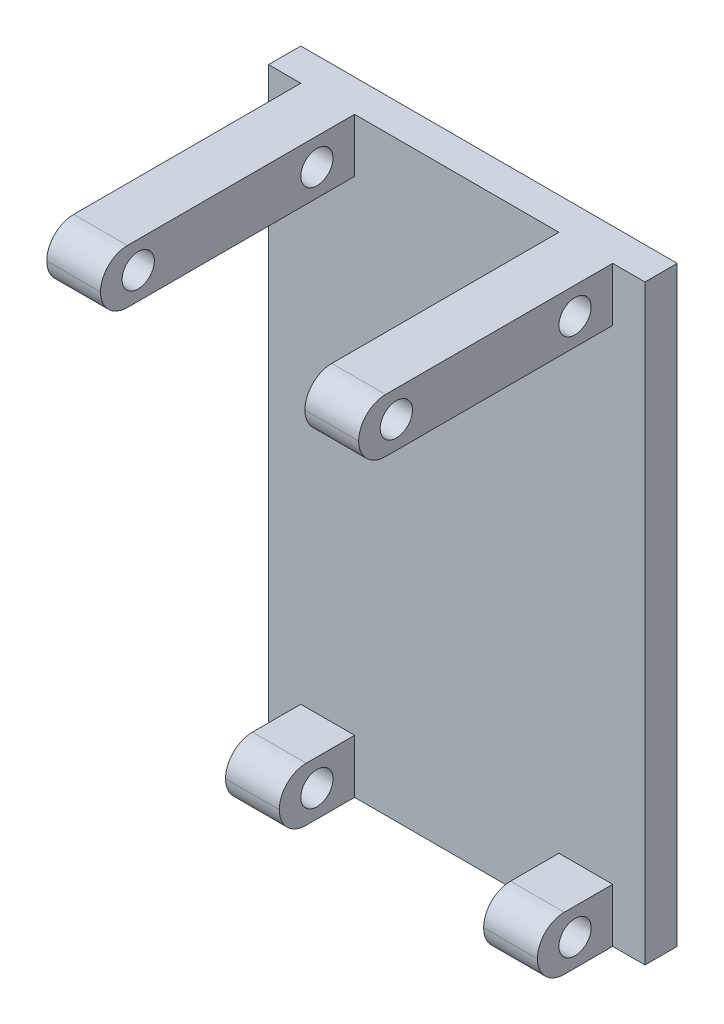
ISO-10303-21;
HEADER;
FILE_DESCRIPTION(('STEP AP214'),'2;1');
FILE_NAME('part.step','',(''),(''),'','','');
FILE_SCHEMA(('AUTOMOTIVE_DESIGN { 1 0 10303 214 1 1 1 1 }'));
ENDSEC;
DATA;
#1=APPLICATION_CONTEXT('core data for automotive mechanical design processes');
#2=APPLICATION_PROTOCOL_DEFINITION('international standard','automotive_design',2000,#1);
#3=PRODUCT_CONTEXT('',#1,'mechanical');
#4=PRODUCT('Part','Part','',(#3));
#5=PRODUCT_RELATED_PRODUCT_CATEGORY('part','',(#4));
#6=PRODUCT_DEFINITION_FORMATION('','',#4);
#7=PRODUCT_DEFINITION_CONTEXT('part definition',#1,'design');
#8=PRODUCT_DEFINITION('design','',#6,#7);
#9=PRODUCT_DEFINITION_SHAPE('','',#8);
#10=(LENGTH_UNIT() NAMED_UNIT(*) SI_UNIT(.MILLI.,.METRE.));
#11=(NAMED_UNIT(*) PLANE_ANGLE_UNIT() SI_UNIT($,.RADIAN.));
#12=(NAMED_UNIT(*) SI_UNIT($,.STERADIAN.) SOLID_ANGLE_UNIT());
#13=UNCERTAINTY_MEASURE_WITH_UNIT(LENGTH_MEASURE(1.E-05),#10,'distance_accuracy_value','');
#14=(GEOMETRIC_REPRESENTATION_CONTEXT(3) GLOBAL_UNCERTAINTY_ASSIGNED_CONTEXT((#13)) GLOBAL_UNIT_ASSIGNED_CONTEXT((#10,
#11,#12)) REPRESENTATION_CONTEXT('',''));
#15=CARTESIAN_POINT('',(0.,0.,0.));
#16=DIRECTION('',(0.,0.,1.));
#17=DIRECTION('',(1.,0.,0.));
#18=AXIS2_PLACEMENT_3D('',#15,#16,#17);
#19=CARTESIAN_POINT('',(0.,0.,3.));
#20=DIRECTION('',(0.,0.,-1.));
#21=DIRECTION('',(-1.,0.,0.));
#22=AXIS2_PLACEMENT_3D('',#19,#20,#21);
#23=PLANE('',#22);
#24=DIRECTION('',(0.,-1.,0.));
#25=VECTOR('',#24,1.);
#26=CARTESIAN_POINT('',(9.50000000000001,-27.5,3.));
#27=LINE('',#26,#25);
#28=CARTESIAN_POINT('',(9.50000000000001,-22.5,3.));
#29=VERTEX_POINT('',#28);
#30=CARTESIAN_POINT('',(9.50000000000001,-27.5,3.));
#31=VERTEX_POINT('',#30);
#32=EDGE_CURVE('E234',#29,#31,#27,.T.);
#33=ORIENTED_EDGE('',*,*,#32,.F.);
#34=DIRECTION('',(-1.,0.,0.));
#35=VECTOR('',#34,1.);
#36=CARTESIAN_POINT('',(9.50000000000001,-22.5,3.));
#37=LINE('',#36,#35);
#38=CARTESIAN_POINT('',(14.5,-22.5,3.));
#39=VERTEX_POINT('',#38);
#40=EDGE_CURVE('E232',#39,#29,#37,.T.);
#41=ORIENTED_EDGE('',*,*,#40,.F.);
#42=DIRECTION('',(0.,1.,0.));
#43=VECTOR('',#42,1.);
#44=CARTESIAN_POINT('',(14.5,-27.5,3.));
#45=LINE('',#44,#43);
#46=CARTESIAN_POINT('',(14.5,-27.5,3.));
#47=VERTEX_POINT('',#46);
#48=EDGE_CURVE('E206',#47,#39,#45,.T.);
#49=ORIENTED_EDGE('',*,*,#48,.F.);
#50=DIRECTION('',(1.,0.,0.));
#51=VECTOR('',#50,1.);
#52=CARTESIAN_POINT('',(-17.5,-27.5,3.));
#53=LINE('',#52,#51);
#54=CARTESIAN_POINT('',(17.5,-27.5,3.));
#55=VERTEX_POINT('',#54);
#56=EDGE_CURVE('E217',#47,#55,#53,.T.);
#57=ORIENTED_EDGE('',*,*,#56,.T.);
#58=DIRECTION('',(0.,1.,0.));
#59=VECTOR('',#58,1.);
#60=CARTESIAN_POINT('',(17.5,-27.5,3.));
#61=LINE('',#60,#59);
#62=CARTESIAN_POINT('',(17.5,27.5,3.));
#63=VERTEX_POINT('',#62);
#64=EDGE_CURVE('E324',#55,#63,#61,.T.);
#65=ORIENTED_EDGE('',*,*,#64,.T.);
#66=DIRECTION('',(-1.,0.,0.));
#67=VECTOR('',#66,1.);
#68=CARTESIAN_POINT('',(-17.5,27.5,3.));
#69=LINE('',#68,#67);
#70=CARTESIAN_POINT('',(14.5,27.5,3.));
#71=VERTEX_POINT('',#70);
#72=EDGE_CURVE('E329',#63,#71,#69,.T.);
#73=ORIENTED_EDGE('',*,*,#72,.T.);
#74=DIRECTION('',(0.,1.,0.));
#75=VECTOR('',#74,1.);
#76=CARTESIAN_POINT('',(14.5,27.5,3.));
#77=LINE('',#76,#75);
#78=CARTESIAN_POINT('',(14.5,22.5,3.));
#79=VERTEX_POINT('',#78);
#80=EDGE_CURVE('E283',#79,#71,#77,.T.);
#81=ORIENTED_EDGE('',*,*,#80,.F.);
#82=DIRECTION('',(1.,0.,0.));
#83=VECTOR('',#82,1.);
#84=CARTESIAN_POINT('',(9.50000000000001,22.5,3.));
#85=LINE('',#84,#83);
#86=CARTESIAN_POINT('',(9.50000000000001,22.5,3.));
#87=VERTEX_POINT('',#86);
#88=EDGE_CURVE('E279',#87,#79,#85,.T.);
#89=ORIENTED_EDGE('',*,*,#88,.F.);
#90=DIRECTION('',(0.,-1.,0.));
#91=VECTOR('',#90,1.);
#92=CARTESIAN_POINT('',(9.5,27.5,3.));
#93=LINE('',#92,#91);
#94=CARTESIAN_POINT('',(9.5,27.5,3.));
#95=VERTEX_POINT('',#94);
#96=EDGE_CURVE('E275',#95,#87,#93,.T.);
#97=ORIENTED_EDGE('',*,*,#96,.F.);
#98=CARTESIAN_POINT('',(-9.5,27.5,3.));
#99=VERTEX_POINT('',#98);
#100=EDGE_CURVE('E333',#95,#99,#69,.T.);
#101=ORIENTED_EDGE('',*,*,#100,.T.);
#102=DIRECTION('',(0.,1.,0.));
#103=VECTOR('',#102,1.);
#104=CARTESIAN_POINT('',(-9.5,27.5,3.));
#105=LINE('',#104,#103);
#106=CARTESIAN_POINT('',(-9.5,22.5,3.));
#107=VERTEX_POINT('',#106);
#108=EDGE_CURVE('E307',#107,#99,#105,.T.);
#109=ORIENTED_EDGE('',*,*,#108,.F.);
#110=DIRECTION('',(1.,0.,0.));
#111=VECTOR('',#110,1.);
#112=CARTESIAN_POINT('',(-14.5,22.5,3.));
#113=LINE('',#112,#111);
#114=CARTESIAN_POINT('',(-14.5,22.5,3.));
#115=VERTEX_POINT('',#114);
#116=EDGE_CURVE('E303',#115,#107,#113,.T.);
#117=ORIENTED_EDGE('',*,*,#116,.F.);
#118=DIRECTION('',(0.,-1.,0.));
#119=VECTOR('',#118,1.);
#120=CARTESIAN_POINT('',(-14.5,27.5,3.));
#121=LINE('',#120,#119);
#122=CARTESIAN_POINT('',(-14.5,27.5,3.));
#123=VERTEX_POINT('',#122);
#124=EDGE_CURVE('E299',#123,#115,#121,.T.);
#125=ORIENTED_EDGE('',*,*,#124,.F.);
#126=CARTESIAN_POINT('',(-17.5,27.5,3.));
#127=VERTEX_POINT('',#126);
#128=EDGE_CURVE('E327',#123,#127,#69,.T.);
#129=ORIENTED_EDGE('',*,*,#128,.T.);
#130=DIRECTION('',(0.,-1.,0.));
#131=VECTOR('',#130,1.);
#132=CARTESIAN_POINT('',(-17.5,-27.5,3.));
#133=LINE('',#132,#131);
#134=CARTESIAN_POINT('',(-17.5,-27.5,3.));
#135=VERTEX_POINT('',#134);
#136=EDGE_CURVE('E226',#127,#135,#133,.T.);
#137=ORIENTED_EDGE('',*,*,#136,.T.);
#138=CARTESIAN_POINT('',(-14.5,-27.5,3.));
#139=VERTEX_POINT('',#138);
#140=EDGE_CURVE('E228',#135,#139,#53,.T.);
#141=ORIENTED_EDGE('',*,*,#140,.T.);
#142=DIRECTION('',(0.,-1.,0.));
#143=VECTOR('',#142,1.);
#144=CARTESIAN_POINT('',(-14.5,-27.5,3.));
#145=LINE('',#144,#143);
#146=CARTESIAN_POINT('',(-14.5,-22.5,3.));
#147=VERTEX_POINT('',#146);
#148=EDGE_CURVE('E259',#147,#139,#145,.T.);
#149=ORIENTED_EDGE('',*,*,#148,.F.);
#150=DIRECTION('',(-1.,0.,0.));
#151=VECTOR('',#150,1.);
#152=CARTESIAN_POINT('',(-9.5,-22.5,3.));
#153=LINE('',#152,#151);
#154=CARTESIAN_POINT('',(-9.5,-22.5,3.));
#155=VERTEX_POINT('',#154);
#156=EDGE_CURVE('E255',#155,#147,#153,.T.);
#157=ORIENTED_EDGE('',*,*,#156,.F.);
#158=DIRECTION('',(0.,1.,0.));
#159=VECTOR('',#158,1.);
#160=CARTESIAN_POINT('',(-9.5,-27.5,3.));
#161=LINE('',#160,#159);
#162=CARTESIAN_POINT('',(-9.5,-27.5,3.));
#163=VERTEX_POINT('',#162);
#164=EDGE_CURVE('E251',#163,#155,#161,.T.);
#165=ORIENTED_EDGE('',*,*,#164,.F.);
#166=EDGE_CURVE('E225',#163,#31,#53,.T.);
#167=ORIENTED_EDGE('',*,*,#166,.T.);
#168=EDGE_LOOP('',(#33,#41,#49,#57,#65,#73,#81,#89,#97,#101,#109,#117,#125,#129,#137,#141,#149,
#157,#165,#167));
#169=FACE_BOUND('',#168,.T.);
#170=ADVANCED_FACE('F39',(#169),#23,.F.);
#171=CARTESIAN_POINT('',(17.5,-27.5,3.));
#172=DIRECTION('',(-1.,0.,0.));
#173=DIRECTION('',(0.,0.,1.));
#174=AXIS2_PLACEMENT_3D('',#171,#172,#173);
#175=PLANE('',#174);
#176=DIRECTION('',(0.,1.,0.));
#177=VECTOR('',#176,1.);
#178=CARTESIAN_POINT('',(17.5,-27.5,0.));
#179=LINE('',#178,#177);
#180=CARTESIAN_POINT('',(17.5,-27.5,0.));
#181=VERTEX_POINT('',#180);
#182=CARTESIAN_POINT('',(17.5,27.5,0.));
#183=VERTEX_POINT('',#182);
#184=EDGE_CURVE('E323',#181,#183,#179,.T.);
#185=ORIENTED_EDGE('',*,*,#184,.T.);
#186=DIRECTION('',(0.,0.,-1.));
#187=VECTOR('',#186,1.);
#188=CARTESIAN_POINT('',(17.5,27.5,3.));
#189=LINE('',#188,#187);
#190=EDGE_CURVE('E359',#63,#183,#189,.T.);
#191=ORIENTED_EDGE('',*,*,#190,.F.);
#192=ORIENTED_EDGE('',*,*,#64,.F.);
#193=DIRECTION('',(0.,0.,-1.));
#194=VECTOR('',#193,1.);
#195=CARTESIAN_POINT('',(17.5,-27.5,3.));
#196=LINE('',#195,#194);
#197=EDGE_CURVE('E220',#55,#181,#196,.T.);
#198=ORIENTED_EDGE('',*,*,#197,.T.);
#199=EDGE_LOOP('',(#185,#191,#192,#198));
#200=FACE_BOUND('',#199,.T.);
#201=ADVANCED_FACE('F495',(#200),#175,.F.);
#202=CARTESIAN_POINT('',(-17.5,27.5,3.));
#203=DIRECTION('',(0.,-1.,0.));
#204=DIRECTION('',(0.,0.,-1.));
#205=AXIS2_PLACEMENT_3D('',#202,#203,#204);
#206=PLANE('',#205);
#207=DIRECTION('',(0.,0.,-1.));
#208=VECTOR('',#207,1.);
#209=CARTESIAN_POINT('',(9.5,27.5,10.));
#210=LINE('',#209,#208);
#211=CARTESIAN_POINT('',(9.5,27.5,24.11764706));
#212=VERTEX_POINT('',#211);
#213=EDGE_CURVE('E287',#212,#95,#210,.T.);
#214=ORIENTED_EDGE('',*,*,#213,.F.);
#215=DIRECTION('',(-1.,0.,0.));
#216=VECTOR('',#215,1.);
#217=CARTESIAN_POINT('',(-17.5,27.5,24.11764706));
#218=LINE('',#217,#216);
#219=CARTESIAN_POINT('',(14.5,27.5,24.11764706));
#220=VERTEX_POINT('',#219);
#221=EDGE_CURVE('E428',#212,#220,#218,.F.);
#222=ORIENTED_EDGE('',*,*,#221,.T.);
#223=DIRECTION('',(0.,0.,-1.));
#224=VECTOR('',#223,1.);
#225=CARTESIAN_POINT('',(14.5,27.5,10.));
#226=LINE('',#225,#224);
#227=EDGE_CURVE('E290',#220,#71,#226,.T.);
#228=ORIENTED_EDGE('',*,*,#227,.T.);
#229=ORIENTED_EDGE('',*,*,#72,.F.);
#230=ORIENTED_EDGE('',*,*,#190,.T.);
#231=DIRECTION('',(-1.,0.,0.));
#232=VECTOR('',#231,1.);
#233=CARTESIAN_POINT('',(-17.5,27.5,0.));
#234=LINE('',#233,#232);
#235=CARTESIAN_POINT('',(-17.5,27.5,0.));
#236=VERTEX_POINT('',#235);
#237=EDGE_CURVE('E341',#183,#236,#234,.T.);
#238=ORIENTED_EDGE('',*,*,#237,.T.);
#239=DIRECTION('',(0.,0.,-1.));
#240=VECTOR('',#239,1.);
#241=CARTESIAN_POINT('',(-17.5,27.5,3.));
#242=LINE('',#241,#240);
#243=EDGE_CURVE('E355',#127,#236,#242,.T.);
#244=ORIENTED_EDGE('',*,*,#243,.F.);
#245=ORIENTED_EDGE('',*,*,#128,.F.);
#246=DIRECTION('',(0.,0.,-1.));
#247=VECTOR('',#246,1.);
#248=CARTESIAN_POINT('',(-14.5,27.5,10.));
#249=LINE('',#248,#247);
#250=CARTESIAN_POINT('',(-14.5,27.5,24.11764706));
#251=VERTEX_POINT('',#250);
#252=EDGE_CURVE('E311',#251,#123,#249,.T.);
#253=ORIENTED_EDGE('',*,*,#252,.F.);
#254=DIRECTION('',(-1.,0.,0.));
#255=VECTOR('',#254,1.);
#256=CARTESIAN_POINT('',(-17.5,27.5,24.11764706));
#257=LINE('',#256,#255);
#258=CARTESIAN_POINT('',(-9.5,27.5,24.11764706));
#259=VERTEX_POINT('',#258);
#260=EDGE_CURVE('E425',#251,#259,#257,.F.);
#261=ORIENTED_EDGE('',*,*,#260,.T.);
#262=DIRECTION('',(0.,0.,-1.));
#263=VECTOR('',#262,1.);
#264=CARTESIAN_POINT('',(-9.5,27.5,10.));
#265=LINE('',#264,#263);
#266=EDGE_CURVE('E314',#259,#99,#265,.T.);
#267=ORIENTED_EDGE('',*,*,#266,.T.);
#268=ORIENTED_EDGE('',*,*,#100,.F.);
#269=EDGE_LOOP('',(#214,#222,#228,#229,#230,#238,#244,#245,#253,#261,#267,#268));
#270=FACE_BOUND('',#269,.T.);
#271=ADVANCED_FACE('F465',(#270),#206,.F.);
#272=CARTESIAN_POINT('',(-17.5,-27.5,3.));
#273=DIRECTION('',(1.,0.,0.));
#274=DIRECTION('',(0.,0.,-1.));
#275=AXIS2_PLACEMENT_3D('',#272,#273,#274);
#276=PLANE('',#275);
#277=DIRECTION('',(0.,-1.,0.));
#278=VECTOR('',#277,1.);
#279=CARTESIAN_POINT('',(-17.5,-27.5,0.));
#280=LINE('',#279,#278);
#281=CARTESIAN_POINT('',(-17.5,-27.5,0.));
#282=VERTEX_POINT('',#281);
#283=EDGE_CURVE('E344',#236,#282,#280,.T.);
#284=ORIENTED_EDGE('',*,*,#283,.T.);
#285=DIRECTION('',(0.,0.,-1.));
#286=VECTOR('',#285,1.);
#287=CARTESIAN_POINT('',(-17.5,-27.5,3.));
#288=LINE('',#287,#286);
#289=EDGE_CURVE('E351',#135,#282,#288,.T.);
#290=ORIENTED_EDGE('',*,*,#289,.F.);
#291=ORIENTED_EDGE('',*,*,#136,.F.);
#292=ORIENTED_EDGE('',*,*,#243,.T.);
#293=EDGE_LOOP('',(#284,#290,#291,#292));
#294=FACE_BOUND('',#293,.T.);
#295=ADVANCED_FACE('F508',(#294),#276,.F.);
#296=CARTESIAN_POINT('',(-17.5,-27.5,3.));
#297=DIRECTION('',(0.,1.,0.));
#298=DIRECTION('',(0.,0.,1.));
#299=AXIS2_PLACEMENT_3D('',#296,#297,#298);
#300=PLANE('',#299);
#301=DIRECTION('',(0.,0.,-1.));
#302=VECTOR('',#301,1.);
#303=CARTESIAN_POINT('',(14.5,-27.5,10.));
#304=LINE('',#303,#302);
#305=CARTESIAN_POINT('',(14.5,-27.5,7.5));
#306=VERTEX_POINT('',#305);
#307=EDGE_CURVE('E201',#306,#47,#304,.T.);
#308=ORIENTED_EDGE('',*,*,#307,.F.);
#309=DIRECTION('',(1.,0.,0.));
#310=VECTOR('',#309,1.);
#311=CARTESIAN_POINT('',(-17.5,-27.5,7.5));
#312=LINE('',#311,#310);
#313=CARTESIAN_POINT('',(9.50000000000001,-27.5,7.5));
#314=VERTEX_POINT('',#313);
#315=EDGE_CURVE('E372',#306,#314,#312,.F.);
#316=ORIENTED_EDGE('',*,*,#315,.T.);
#317=DIRECTION('',(0.,0.,-1.));
#318=VECTOR('',#317,1.);
#319=CARTESIAN_POINT('',(9.50000000000001,-27.5,10.));
#320=LINE('',#319,#318);
#321=EDGE_CURVE('E213',#314,#31,#320,.T.);
#322=ORIENTED_EDGE('',*,*,#321,.T.);
#323=ORIENTED_EDGE('',*,*,#166,.F.);
#324=DIRECTION('',(0.,0.,-1.));
#325=VECTOR('',#324,1.);
#326=CARTESIAN_POINT('',(-9.5,-27.5,10.));
#327=LINE('',#326,#325);
#328=CARTESIAN_POINT('',(-9.5,-27.5,7.5));
#329=VERTEX_POINT('',#328);
#330=EDGE_CURVE('E263',#329,#163,#327,.T.);
#331=ORIENTED_EDGE('',*,*,#330,.F.);
#332=DIRECTION('',(1.,0.,0.));
#333=VECTOR('',#332,1.);
#334=CARTESIAN_POINT('',(-14.5,-27.5,7.5));
#335=LINE('',#334,#333);
#336=CARTESIAN_POINT('',(-14.5,-27.5,7.5));
#337=VERTEX_POINT('',#336);
#338=EDGE_CURVE('E368',#329,#337,#335,.F.);
#339=ORIENTED_EDGE('',*,*,#338,.T.);
#340=DIRECTION('',(0.,0.,-1.));
#341=VECTOR('',#340,1.);
#342=CARTESIAN_POINT('',(-14.5,-27.5,10.));
#343=LINE('',#342,#341);
#344=EDGE_CURVE('E266',#337,#139,#343,.T.);
#345=ORIENTED_EDGE('',*,*,#344,.T.);
#346=ORIENTED_EDGE('',*,*,#140,.F.);
#347=ORIENTED_EDGE('',*,*,#289,.T.);
#348=DIRECTION('',(1.,0.,0.));
#349=VECTOR('',#348,1.);
#350=CARTESIAN_POINT('',(-17.5,-27.5,0.));
#351=LINE('',#350,#349);
#352=EDGE_CURVE('E328',#282,#181,#351,.T.);
#353=ORIENTED_EDGE('',*,*,#352,.T.);
#354=ORIENTED_EDGE('',*,*,#197,.F.);
#355=ORIENTED_EDGE('',*,*,#56,.F.);
#356=EDGE_LOOP('',(#308,#316,#322,#323,#331,#339,#345,#346,#347,#353,#354,#355));
#357=FACE_BOUND('',#356,.T.);
#358=ADVANCED_FACE('F218',(#357),#300,.F.);
#359=CARTESIAN_POINT('',(0.,0.,0.));
#360=DIRECTION('',(0.,0.,-1.));
#361=DIRECTION('',(-1.,0.,0.));
#362=AXIS2_PLACEMENT_3D('',#359,#360,#361);
#363=PLANE('',#362);
#364=ORIENTED_EDGE('',*,*,#184,.F.);
#365=ORIENTED_EDGE('',*,*,#352,.F.);
#366=ORIENTED_EDGE('',*,*,#283,.F.);
#367=ORIENTED_EDGE('',*,*,#237,.F.);
#368=EDGE_LOOP('',(#364,#365,#366,#367));
#369=FACE_BOUND('',#368,.T.);
#370=ADVANCED_FACE('F491',(#369),#363,.T.);
#371=CARTESIAN_POINT('',(-14.5,27.5,10.));
#372=DIRECTION('',(1.,0.,0.));
#373=DIRECTION('',(0.,1.,0.));
#374=AXIS2_PLACEMENT_3D('',#371,#372,#373);
#375=PLANE('',#374);
#376=CARTESIAN_POINT('',(-14.5,25.,23.11764706));
#377=DIRECTION('',(-1.,0.,0.));
#378=DIRECTION('',(0.,-1.,0.));
#379=AXIS2_PLACEMENT_3D('',#376,#377,#378);
#380=CIRCLE('',#379,1.5);
#381=CARTESIAN_POINT('',(-14.5,23.5,23.11764706));
#382=VERTEX_POINT('',#381);
#383=EDGE_CURVE('E444',#382,#382,#380,.T.);
#384=ORIENTED_EDGE('',*,*,#383,.F.);
#385=EDGE_LOOP('',(#384));
#386=FACE_BOUND('',#385,.T.);
#387=CARTESIAN_POINT('',(-14.5,25.,6.5));
#388=DIRECTION('',(-1.,0.,0.));
#389=DIRECTION('',(0.,-1.,0.));
#390=AXIS2_PLACEMENT_3D('',#387,#388,#389);
#391=CIRCLE('',#390,1.5);
#392=CARTESIAN_POINT('',(-14.5,23.5,6.5));
#393=VERTEX_POINT('',#392);
#394=EDGE_CURVE('E884',#393,#393,#391,.T.);
#395=ORIENTED_EDGE('',*,*,#394,.F.);
#396=EDGE_LOOP('',(#395));
#397=FACE_BOUND('',#396,.T.);
#398=DIRECTION('',(0.,0.,-1.));
#399=VECTOR('',#398,1.);
#400=CARTESIAN_POINT('',(-14.5,22.5,10.));
#401=LINE('',#400,#399);
#402=CARTESIAN_POINT('',(-14.5,22.5,24.11764706));
#403=VERTEX_POINT('',#402);
#404=EDGE_CURVE('E320',#403,#115,#401,.T.);
#405=ORIENTED_EDGE('',*,*,#404,.F.);
#406=CARTESIAN_POINT('',(-14.5,25.,24.11764706));
#407=DIRECTION('',(1.,0.,0.));
#408=DIRECTION('',(0.,1.,0.));
#409=AXIS2_PLACEMENT_3D('',#406,#407,#408);
#410=CIRCLE('',#409,2.5);
#411=CARTESIAN_POINT('',(-14.5,25.,26.61764706));
#412=VERTEX_POINT('',#411);
#413=EDGE_CURVE('E11',#403,#412,#410,.F.);
#414=ORIENTED_EDGE('',*,*,#413,.T.);
#415=CARTESIAN_POINT('',(-14.5,25.,24.11764706));
#416=DIRECTION('',(1.,0.,0.));
#417=DIRECTION('',(0.,1.,0.));
#418=AXIS2_PLACEMENT_3D('',#415,#416,#417);
#419=CIRCLE('',#418,2.5);
#420=EDGE_CURVE('E49',#412,#251,#419,.F.);
#421=ORIENTED_EDGE('',*,*,#420,.T.);
#422=ORIENTED_EDGE('',*,*,#252,.T.);
#423=ORIENTED_EDGE('',*,*,#124,.T.);
#424=EDGE_LOOP('',(#405,#414,#421,#422,#423));
#425=FACE_BOUND('',#424,.T.);
#426=ADVANCED_FACE('F460',(#386,#397,#425),#375,.F.);
#427=CARTESIAN_POINT('',(-14.5,22.5,10.));
#428=DIRECTION('',(0.,1.,0.));
#429=DIRECTION('',(0.,0.,1.));
#430=AXIS2_PLACEMENT_3D('',#427,#428,#429);
#431=PLANE('',#430);
#432=DIRECTION('',(0.,0.,-1.));
#433=VECTOR('',#432,1.);
#434=CARTESIAN_POINT('',(-9.5,22.5,10.));
#435=LINE('',#434,#433);
#436=CARTESIAN_POINT('',(-9.5,22.5,24.11764706));
#437=VERTEX_POINT('',#436);
#438=EDGE_CURVE('E317',#437,#107,#435,.T.);
#439=ORIENTED_EDGE('',*,*,#438,.F.);
#440=DIRECTION('',(1.,0.,0.));
#441=VECTOR('',#440,1.);
#442=CARTESIAN_POINT('',(-14.5,22.5,24.11764706));
#443=LINE('',#442,#441);
#444=EDGE_CURVE('E437',#437,#403,#443,.F.);
#445=ORIENTED_EDGE('',*,*,#444,.T.);
#446=ORIENTED_EDGE('',*,*,#404,.T.);
#447=ORIENTED_EDGE('',*,*,#116,.T.);
#448=EDGE_LOOP('',(#439,#445,#446,#447));
#449=FACE_BOUND('',#448,.T.);
#450=ADVANCED_FACE('F481',(#449),#431,.F.);
#451=CARTESIAN_POINT('',(-9.5,27.5,10.));
#452=DIRECTION('',(-1.,0.,0.));
#453=DIRECTION('',(0.,0.,1.));
#454=AXIS2_PLACEMENT_3D('',#451,#452,#453);
#455=PLANE('',#454);
#456=CARTESIAN_POINT('',(-9.5,25.,23.11764706));
#457=DIRECTION('',(-1.,0.,0.));
#458=DIRECTION('',(0.,0.,1.));
#459=AXIS2_PLACEMENT_3D('',#456,#457,#458);
#460=CIRCLE('',#459,1.5);
#461=CARTESIAN_POINT('',(-9.5,25.,24.61764706));
#462=VERTEX_POINT('',#461);
#463=EDGE_CURVE('E409',#462,#462,#460,.T.);
#464=ORIENTED_EDGE('',*,*,#463,.T.);
#465=EDGE_LOOP('',(#464));
#466=FACE_BOUND('',#465,.T.);
#467=CARTESIAN_POINT('',(-9.5,25.,6.5));
#468=DIRECTION('',(-1.,0.,0.));
#469=DIRECTION('',(0.,0.,1.));
#470=AXIS2_PLACEMENT_3D('',#467,#468,#469);
#471=CIRCLE('',#470,1.5);
#472=CARTESIAN_POINT('',(-9.5,25.,8.));
#473=VERTEX_POINT('',#472);
#474=EDGE_CURVE('E241',#473,#473,#471,.T.);
#475=ORIENTED_EDGE('',*,*,#474,.T.);
#476=EDGE_LOOP('',(#475));
#477=FACE_BOUND('',#476,.T.);
#478=CARTESIAN_POINT('',(-9.5,25.,24.11764706));
#479=DIRECTION('',(-1.,0.,0.));
#480=DIRECTION('',(0.,0.,1.));
#481=AXIS2_PLACEMENT_3D('',#478,#479,#480);
#482=CIRCLE('',#481,2.5);
#483=CARTESIAN_POINT('',(-9.5,25.,26.61764706));
#484=VERTEX_POINT('',#483);
#485=EDGE_CURVE('E431',#259,#484,#482,.F.);
#486=ORIENTED_EDGE('',*,*,#485,.T.);
#487=CARTESIAN_POINT('',(-9.5,25.,24.11764706));
#488=DIRECTION('',(-1.,0.,0.));
#489=DIRECTION('',(0.,0.,1.));
#490=AXIS2_PLACEMENT_3D('',#487,#488,#489);
#491=CIRCLE('',#490,2.5);
#492=EDGE_CURVE('E434',#484,#437,#491,.F.);
#493=ORIENTED_EDGE('',*,*,#492,.T.);
#494=ORIENTED_EDGE('',*,*,#438,.T.);
#495=ORIENTED_EDGE('',*,*,#108,.T.);
#496=ORIENTED_EDGE('',*,*,#266,.F.);
#497=EDGE_LOOP('',(#486,#493,#494,#495,#496));
#498=FACE_BOUND('',#497,.T.);
#499=ADVANCED_FACE('F478',(#466,#477,#498),#455,.F.);
#500=CARTESIAN_POINT('',(9.5,27.5,10.));
#501=DIRECTION('',(1.,0.,0.));
#502=DIRECTION('',(0.,1.,0.));
#503=AXIS2_PLACEMENT_3D('',#500,#501,#502);
#504=PLANE('',#503);
#505=CARTESIAN_POINT('',(9.5,25.,23.11764706));
#506=DIRECTION('',(1.,0.,0.));
#507=DIRECTION('',(0.,1.,0.));
#508=AXIS2_PLACEMENT_3D('',#505,#506,#507);
#509=CIRCLE('',#508,1.5);
#510=CARTESIAN_POINT('',(9.5,26.5,23.11764706));
#511=VERTEX_POINT('',#510);
#512=EDGE_CURVE('E820',#511,#511,#509,.T.);
#513=ORIENTED_EDGE('',*,*,#512,.T.);
#514=EDGE_LOOP('',(#513));
#515=FACE_BOUND('',#514,.T.);
#516=CARTESIAN_POINT('',(9.5,25.,6.5));
#517=DIRECTION('',(1.,0.,0.));
#518=DIRECTION('',(0.,1.,0.));
#519=AXIS2_PLACEMENT_3D('',#516,#517,#518);
#520=CIRCLE('',#519,1.5);
#521=CARTESIAN_POINT('',(9.5,26.5,6.5));
#522=VERTEX_POINT('',#521);
#523=EDGE_CURVE('E824',#522,#522,#520,.T.);
#524=ORIENTED_EDGE('',*,*,#523,.T.);
#525=EDGE_LOOP('',(#524));
#526=FACE_BOUND('',#525,.T.);
#527=DIRECTION('',(0.,0.,-1.));
#528=VECTOR('',#527,1.);
#529=CARTESIAN_POINT('',(9.50000000000001,22.5,10.));
#530=LINE('',#529,#528);
#531=CARTESIAN_POINT('',(9.50000000000001,22.5,24.11764706));
#532=VERTEX_POINT('',#531);
#533=EDGE_CURVE('E296',#532,#87,#530,.T.);
#534=ORIENTED_EDGE('',*,*,#533,.F.);
#535=CARTESIAN_POINT('',(9.5,25.,24.11764706));
#536=DIRECTION('',(1.,0.,0.));
#537=DIRECTION('',(0.,1.,0.));
#538=AXIS2_PLACEMENT_3D('',#535,#536,#537);
#539=CIRCLE('',#538,2.5);
#540=CARTESIAN_POINT('',(9.50000000000001,25.,26.61764706));
#541=VERTEX_POINT('',#540);
#542=EDGE_CURVE('E422',#532,#541,#539,.F.);
#543=ORIENTED_EDGE('',*,*,#542,.T.);
#544=CARTESIAN_POINT('',(9.5,25.,24.11764706));
#545=DIRECTION('',(1.,0.,0.));
#546=DIRECTION('',(0.,1.,0.));
#547=AXIS2_PLACEMENT_3D('',#544,#545,#546);
#548=CIRCLE('',#547,2.5);
#549=EDGE_CURVE('E419',#541,#212,#548,.F.);
#550=ORIENTED_EDGE('',*,*,#549,.T.);
#551=ORIENTED_EDGE('',*,*,#213,.T.);
#552=ORIENTED_EDGE('',*,*,#96,.T.);
#553=EDGE_LOOP('',(#534,#543,#550,#551,#552));
#554=FACE_BOUND('',#553,.T.);
#555=ADVANCED_FACE('F488',(#515,#526,#554),#504,.F.);
#556=CARTESIAN_POINT('',(9.50000000000001,22.5,10.));
#557=DIRECTION('',(0.,1.,0.));
#558=DIRECTION('',(-1.,0.,0.));
#559=AXIS2_PLACEMENT_3D('',#556,#557,#558);
#560=PLANE('',#559);
#561=DIRECTION('',(0.,0.,-1.));
#562=VECTOR('',#561,1.);
#563=CARTESIAN_POINT('',(14.5,22.5,10.));
#564=LINE('',#563,#562);
#565=CARTESIAN_POINT('',(14.5,22.5,24.11764706));
#566=VERTEX_POINT('',#565);
#567=EDGE_CURVE('E293',#566,#79,#564,.T.);
#568=ORIENTED_EDGE('',*,*,#567,.F.);
#569=DIRECTION('',(1.,0.,0.));
#570=VECTOR('',#569,1.);
#571=CARTESIAN_POINT('',(9.50000000000001,22.5,24.11764706));
#572=LINE('',#571,#570);
#573=EDGE_CURVE('E415',#566,#532,#572,.F.);
#574=ORIENTED_EDGE('',*,*,#573,.T.);
#575=ORIENTED_EDGE('',*,*,#533,.T.);
#576=ORIENTED_EDGE('',*,*,#88,.T.);
#577=EDGE_LOOP('',(#568,#574,#575,#576));
#578=FACE_BOUND('',#577,.T.);
#579=ADVANCED_FACE('F667',(#578),#560,.F.);
#580=CARTESIAN_POINT('',(14.5,27.5,10.));
#581=DIRECTION('',(-1.,0.,0.));
#582=DIRECTION('',(0.,0.,1.));
#583=AXIS2_PLACEMENT_3D('',#580,#581,#582);
#584=PLANE('',#583);
#585=CARTESIAN_POINT('',(14.5,25.,23.11764706));
#586=DIRECTION('',(-1.,0.,0.));
#587=DIRECTION('',(0.,0.,1.));
#588=AXIS2_PLACEMENT_3D('',#585,#586,#587);
#589=CIRCLE('',#588,1.5);
#590=CARTESIAN_POINT('',(14.5,25.,24.61764706));
#591=VERTEX_POINT('',#590);
#592=EDGE_CURVE('E451',#591,#591,#589,.F.);
#593=ORIENTED_EDGE('',*,*,#592,.F.);
#594=EDGE_LOOP('',(#593));
#595=FACE_BOUND('',#594,.T.);
#596=CARTESIAN_POINT('',(14.5,25.,6.5));
#597=DIRECTION('',(-1.,0.,0.));
#598=DIRECTION('',(0.,0.,1.));
#599=AXIS2_PLACEMENT_3D('',#596,#597,#598);
#600=CIRCLE('',#599,1.5);
#601=CARTESIAN_POINT('',(14.5,25.,8.));
#602=VERTEX_POINT('',#601);
#603=EDGE_CURVE('E879',#602,#602,#600,.F.);
#604=ORIENTED_EDGE('',*,*,#603,.F.);
#605=EDGE_LOOP('',(#604));
#606=FACE_BOUND('',#605,.T.);
#607=CARTESIAN_POINT('',(14.5,25.,24.11764706));
#608=DIRECTION('',(-1.,0.,0.));
#609=DIRECTION('',(0.,0.,1.));
#610=AXIS2_PLACEMENT_3D('',#607,#608,#609);
#611=CIRCLE('',#610,2.5);
#612=CARTESIAN_POINT('',(14.5,25.,26.61764706));
#613=VERTEX_POINT('',#612);
#614=EDGE_CURVE('E399',#220,#613,#611,.F.);
#615=ORIENTED_EDGE('',*,*,#614,.T.);
#616=CARTESIAN_POINT('',(14.5,25.,24.11764706));
#617=DIRECTION('',(-1.,0.,0.));
#618=DIRECTION('',(0.,0.,1.));
#619=AXIS2_PLACEMENT_3D('',#616,#617,#618);
#620=CIRCLE('',#619,2.5);
#621=EDGE_CURVE('E412',#613,#566,#620,.F.);
#622=ORIENTED_EDGE('',*,*,#621,.T.);
#623=ORIENTED_EDGE('',*,*,#567,.T.);
#624=ORIENTED_EDGE('',*,*,#80,.T.);
#625=ORIENTED_EDGE('',*,*,#227,.F.);
#626=EDGE_LOOP('',(#615,#622,#623,#624,#625));
#627=FACE_BOUND('',#626,.T.);
#628=ADVANCED_FACE('F660',(#595,#606,#627),#584,.F.);
#629=CARTESIAN_POINT('',(-9.5,-27.5,10.));
#630=DIRECTION('',(-1.,0.,0.));
#631=DIRECTION('',(0.,-1.,0.));
#632=AXIS2_PLACEMENT_3D('',#629,#630,#631);
#633=PLANE('',#632);
#634=CARTESIAN_POINT('',(-9.49999999999999,-25.,6.5));
#635=DIRECTION('',(-1.,0.,0.));
#636=DIRECTION('',(0.,-1.,0.));
#637=AXIS2_PLACEMENT_3D('',#634,#635,#636);
#638=CIRCLE('',#637,1.5);
#639=CARTESIAN_POINT('',(-9.49999999999999,-26.5,6.5));
#640=VERTEX_POINT('',#639);
#641=EDGE_CURVE('E867',#640,#640,#638,.T.);
#642=ORIENTED_EDGE('',*,*,#641,.T.);
#643=EDGE_LOOP('',(#642));
#644=FACE_BOUND('',#643,.T.);
#645=CARTESIAN_POINT('',(-9.5,-25.,7.5));
#646=DIRECTION('',(-1.,0.,0.));
#647=DIRECTION('',(0.,-1.,0.));
#648=AXIS2_PLACEMENT_3D('',#645,#646,#647);
#649=CIRCLE('',#648,2.5);
#650=CARTESIAN_POINT('',(-9.5,-22.5,7.5));
#651=VERTEX_POINT('',#650);
#652=CARTESIAN_POINT('',(-9.5,-25.,10.));
#653=VERTEX_POINT('',#652);
#654=EDGE_CURVE('E384',#651,#653,#649,.F.);
#655=ORIENTED_EDGE('',*,*,#654,.T.);
#656=CARTESIAN_POINT('',(-9.5,-25.,7.5));
#657=DIRECTION('',(-1.,0.,0.));
#658=DIRECTION('',(0.,-1.,0.));
#659=AXIS2_PLACEMENT_3D('',#656,#657,#658);
#660=CIRCLE('',#659,2.5);
#661=EDGE_CURVE('E387',#653,#329,#660,.F.);
#662=ORIENTED_EDGE('',*,*,#661,.T.);
#663=ORIENTED_EDGE('',*,*,#330,.T.);
#664=ORIENTED_EDGE('',*,*,#164,.T.);
#665=DIRECTION('',(0.,0.,-1.));
#666=VECTOR('',#665,1.);
#667=CARTESIAN_POINT('',(-9.5,-22.5,10.));
#668=LINE('',#667,#666);
#669=EDGE_CURVE('E272',#651,#155,#668,.T.);
#670=ORIENTED_EDGE('',*,*,#669,.F.);
#671=EDGE_LOOP('',(#655,#662,#663,#664,#670));
#672=FACE_BOUND('',#671,.T.);
#673=ADVANCED_FACE('F652',(#644,#672),#633,.F.);
#674=CARTESIAN_POINT('',(-9.5,-22.5,10.));
#675=DIRECTION('',(0.,-1.,0.));
#676=DIRECTION('',(0.,0.,-1.));
#677=AXIS2_PLACEMENT_3D('',#674,#675,#676);
#678=PLANE('',#677);
#679=DIRECTION('',(0.,0.,-1.));
#680=VECTOR('',#679,1.);
#681=CARTESIAN_POINT('',(-14.5,-22.5,10.));
#682=LINE('',#681,#680);
#683=CARTESIAN_POINT('',(-14.5,-22.5,7.5));
#684=VERTEX_POINT('',#683);
#685=EDGE_CURVE('E269',#684,#147,#682,.T.);
#686=ORIENTED_EDGE('',*,*,#685,.F.);
#687=DIRECTION('',(-1.,0.,0.));
#688=VECTOR('',#687,1.);
#689=CARTESIAN_POINT('',(-9.5,-22.5,7.5));
#690=LINE('',#689,#688);
#691=EDGE_CURVE('E396',#684,#651,#690,.F.);
#692=ORIENTED_EDGE('',*,*,#691,.T.);
#693=ORIENTED_EDGE('',*,*,#669,.T.);
#694=ORIENTED_EDGE('',*,*,#156,.T.);
#695=EDGE_LOOP('',(#686,#692,#693,#694));
#696=FACE_BOUND('',#695,.T.);
#697=ADVANCED_FACE('F644',(#696),#678,.F.);
#698=CARTESIAN_POINT('',(-14.5,-27.5,10.));
#699=DIRECTION('',(1.,0.,0.));
#700=DIRECTION('',(0.,0.,-1.));
#701=AXIS2_PLACEMENT_3D('',#698,#699,#700);
#702=PLANE('',#701);
#703=CARTESIAN_POINT('',(-14.5,-25.,6.5));
#704=DIRECTION('',(-1.,0.,0.));
#705=DIRECTION('',(0.,-1.,0.));
#706=AXIS2_PLACEMENT_3D('',#703,#704,#705);
#707=CIRCLE('',#706,1.5);
#708=CARTESIAN_POINT('',(-14.5,-26.5,6.5));
#709=VERTEX_POINT('',#708);
#710=EDGE_CURVE('E404',#709,#709,#707,.T.);
#711=ORIENTED_EDGE('',*,*,#710,.F.);
#712=EDGE_LOOP('',(#711));
#713=FACE_BOUND('',#712,.T.);
#714=ORIENTED_EDGE('',*,*,#344,.F.);
#715=CARTESIAN_POINT('',(-14.5,-25.,7.5));
#716=DIRECTION('',(1.,0.,0.));
#717=DIRECTION('',(0.,0.,-1.));
#718=AXIS2_PLACEMENT_3D('',#715,#716,#717);
#719=CIRCLE('',#718,2.5);
#720=CARTESIAN_POINT('',(-14.5,-25.,10.));
#721=VERTEX_POINT('',#720);
#722=EDGE_CURVE('E393',#337,#721,#719,.F.);
#723=ORIENTED_EDGE('',*,*,#722,.T.);
#724=CARTESIAN_POINT('',(-14.5,-25.,7.5));
#725=DIRECTION('',(1.,0.,0.));
#726=DIRECTION('',(0.,0.,-1.));
#727=AXIS2_PLACEMENT_3D('',#724,#725,#726);
#728=CIRCLE('',#727,2.5);
#729=EDGE_CURVE('E390',#721,#684,#728,.F.);
#730=ORIENTED_EDGE('',*,*,#729,.T.);
#731=ORIENTED_EDGE('',*,*,#685,.T.);
#732=ORIENTED_EDGE('',*,*,#148,.T.);
#733=EDGE_LOOP('',(#714,#723,#730,#731,#732));
#734=FACE_BOUND('',#733,.T.);
#735=ADVANCED_FACE('F636',(#713,#734),#702,.F.);
#736=CARTESIAN_POINT('',(9.50000000000001,-27.5,10.));
#737=DIRECTION('',(1.,0.,0.));
#738=DIRECTION('',(0.,0.,-1.));
#739=AXIS2_PLACEMENT_3D('',#736,#737,#738);
#740=PLANE('',#739);
#741=CARTESIAN_POINT('',(9.50000000000001,-25.,6.5));
#742=DIRECTION('',(1.,0.,0.));
#743=DIRECTION('',(0.,0.,-1.));
#744=AXIS2_PLACEMENT_3D('',#741,#742,#743);
#745=CIRCLE('',#744,1.5);
#746=CARTESIAN_POINT('',(9.50000000000001,-25.,5.));
#747=VERTEX_POINT('',#746);
#748=EDGE_CURVE('E873',#747,#747,#745,.T.);
#749=ORIENTED_EDGE('',*,*,#748,.T.);
#750=EDGE_LOOP('',(#749));
#751=FACE_BOUND('',#750,.T.);
#752=ORIENTED_EDGE('',*,*,#321,.F.);
#753=CARTESIAN_POINT('',(9.50000000000001,-25.,7.5));
#754=DIRECTION('',(1.,0.,0.));
#755=DIRECTION('',(0.,0.,-1.));
#756=AXIS2_PLACEMENT_3D('',#753,#754,#755);
#757=CIRCLE('',#756,2.5);
#758=CARTESIAN_POINT('',(9.50000000000001,-25.,10.));
#759=VERTEX_POINT('',#758);
#760=EDGE_CURVE('E378',#314,#759,#757,.F.);
#761=ORIENTED_EDGE('',*,*,#760,.T.);
#762=CARTESIAN_POINT('',(9.50000000000001,-25.,7.5));
#763=DIRECTION('',(1.,0.,0.));
#764=DIRECTION('',(0.,0.,-1.));
#765=AXIS2_PLACEMENT_3D('',#762,#763,#764);
#766=CIRCLE('',#765,2.5);
#767=CARTESIAN_POINT('',(9.50000000000001,-22.5,7.5));
#768=VERTEX_POINT('',#767);
#769=EDGE_CURVE('E375',#759,#768,#766,.F.);
#770=ORIENTED_EDGE('',*,*,#769,.T.);
#771=DIRECTION('',(0.,0.,-1.));
#772=VECTOR('',#771,1.);
#773=CARTESIAN_POINT('',(9.50000000000001,-22.5,10.));
#774=LINE('',#773,#772);
#775=EDGE_CURVE('E238',#768,#29,#774,.T.);
#776=ORIENTED_EDGE('',*,*,#775,.T.);
#777=ORIENTED_EDGE('',*,*,#32,.T.);
#778=EDGE_LOOP('',(#752,#761,#770,#776,#777));
#779=FACE_BOUND('',#778,.T.);
#780=ADVANCED_FACE('F628',(#751,#779),#740,.F.);
#781=CARTESIAN_POINT('',(14.5,-27.5,10.));
#782=DIRECTION('',(-1.,0.,0.));
#783=DIRECTION('',(0.,-1.,0.));
#784=AXIS2_PLACEMENT_3D('',#781,#782,#783);
#785=PLANE('',#784);
#786=CARTESIAN_POINT('',(14.5,-25.,6.5));
#787=DIRECTION('',(-1.,0.,0.));
#788=DIRECTION('',(0.,0.,1.));
#789=AXIS2_PLACEMENT_3D('',#786,#787,#788);
#790=CIRCLE('',#789,1.5);
#791=CARTESIAN_POINT('',(14.5,-25.,8.));
#792=VERTEX_POINT('',#791);
#793=EDGE_CURVE('E880',#792,#792,#790,.F.);
#794=ORIENTED_EDGE('',*,*,#793,.F.);
#795=EDGE_LOOP('',(#794));
#796=FACE_BOUND('',#795,.T.);
#797=CARTESIAN_POINT('',(14.5,-25.,7.5));
#798=DIRECTION('',(-1.,0.,0.));
#799=DIRECTION('',(0.,-1.,0.));
#800=AXIS2_PLACEMENT_3D('',#797,#798,#799);
#801=CIRCLE('',#800,2.5);
#802=CARTESIAN_POINT('',(14.5,-22.5,7.5));
#803=VERTEX_POINT('',#802);
#804=CARTESIAN_POINT('',(14.5,-25.,10.));
#805=VERTEX_POINT('',#804);
#806=EDGE_CURVE('E363',#803,#805,#801,.F.);
#807=ORIENTED_EDGE('',*,*,#806,.T.);
#808=CARTESIAN_POINT('',(14.5,-25.,7.5));
#809=DIRECTION('',(-1.,0.,0.));
#810=DIRECTION('',(0.,-1.,0.));
#811=AXIS2_PLACEMENT_3D('',#808,#809,#810);
#812=CIRCLE('',#811,2.5);
#813=EDGE_CURVE('E208',#805,#306,#812,.F.);
#814=ORIENTED_EDGE('',*,*,#813,.T.);
#815=ORIENTED_EDGE('',*,*,#307,.T.);
#816=ORIENTED_EDGE('',*,*,#48,.T.);
#817=DIRECTION('',(0.,0.,-1.));
#818=VECTOR('',#817,1.);
#819=CARTESIAN_POINT('',(14.5,-22.5,10.));
#820=LINE('',#819,#818);
#821=EDGE_CURVE('E214',#803,#39,#820,.T.);
#822=ORIENTED_EDGE('',*,*,#821,.F.);
#823=EDGE_LOOP('',(#807,#814,#815,#816,#822));
#824=FACE_BOUND('',#823,.T.);
#825=ADVANCED_FACE('F203',(#796,#824),#785,.F.);
#826=CARTESIAN_POINT('',(9.50000000000001,-22.5,10.));
#827=DIRECTION('',(0.,-1.,0.));
#828=DIRECTION('',(0.,0.,-1.));
#829=AXIS2_PLACEMENT_3D('',#826,#827,#828);
#830=PLANE('',#829);
#831=ORIENTED_EDGE('',*,*,#775,.F.);
#832=DIRECTION('',(-1.,0.,0.));
#833=VECTOR('',#832,1.);
#834=CARTESIAN_POINT('',(9.50000000000001,-22.5,7.5));
#835=LINE('',#834,#833);
#836=EDGE_CURVE('E381',#768,#803,#835,.F.);
#837=ORIENTED_EDGE('',*,*,#836,.T.);
#838=ORIENTED_EDGE('',*,*,#821,.T.);
#839=ORIENTED_EDGE('',*,*,#40,.T.);
#840=EDGE_LOOP('',(#831,#837,#838,#839));
#841=FACE_BOUND('',#840,.T.);
#842=ADVANCED_FACE('F615',(#841),#830,.F.);
#843=CARTESIAN_POINT('',(18.7426406871193,-25.,6.5));
#844=DIRECTION('',(-1.,0.,0.));
#845=DIRECTION('',(0.,-1.,0.));
#846=AXIS2_PLACEMENT_3D('',#843,#844,#845);
#847=CYLINDRICAL_SURFACE('',#846,1.5);
#848=ORIENTED_EDGE('',*,*,#793,.T.);
#849=EDGE_LOOP('',(#848));
#850=FACE_BOUND('',#849,.T.);
#851=ORIENTED_EDGE('',*,*,#748,.F.);
#852=EDGE_LOOP('',(#851));
#853=FACE_BOUND('',#852,.T.);
#854=ADVANCED_FACE('F607',(#850,#853),#847,.F.);
#855=ORIENTED_EDGE('',*,*,#710,.T.);
#856=EDGE_LOOP('',(#855));
#857=FACE_BOUND('',#856,.T.);
#858=ORIENTED_EDGE('',*,*,#641,.F.);
#859=EDGE_LOOP('',(#858));
#860=FACE_BOUND('',#859,.T.);
#861=ADVANCED_FACE('F600',(#857,#860),#847,.F.);
#862=CARTESIAN_POINT('',(18.7426406871193,25.,6.5));
#863=DIRECTION('',(-1.,0.,0.));
#864=DIRECTION('',(0.,-1.,0.));
#865=AXIS2_PLACEMENT_3D('',#862,#863,#864);
#866=CYLINDRICAL_SURFACE('',#865,1.5);
#867=ORIENTED_EDGE('',*,*,#603,.T.);
#868=EDGE_LOOP('',(#867));
#869=FACE_BOUND('',#868,.T.);
#870=ORIENTED_EDGE('',*,*,#523,.F.);
#871=EDGE_LOOP('',(#870));
#872=FACE_BOUND('',#871,.T.);
#873=ADVANCED_FACE('F591',(#869,#872),#866,.F.);
#874=ORIENTED_EDGE('',*,*,#394,.T.);
#875=EDGE_LOOP('',(#874));
#876=FACE_BOUND('',#875,.T.);
#877=ORIENTED_EDGE('',*,*,#474,.F.);
#878=EDGE_LOOP('',(#877));
#879=FACE_BOUND('',#878,.T.);
#880=ADVANCED_FACE('F522',(#876,#879),#866,.F.);
#881=CARTESIAN_POINT('',(0.,-25.,7.5));
#882=DIRECTION('',(-1.,0.,0.));
#883=DIRECTION('',(0.,0.,1.));
#884=AXIS2_PLACEMENT_3D('',#881,#882,#883);
#885=CYLINDRICAL_SURFACE('',#884,2.5);
#886=ORIENTED_EDGE('',*,*,#836,.F.);
#887=ORIENTED_EDGE('',*,*,#769,.F.);
#888=DIRECTION('',(-1.,0.,0.));
#889=VECTOR('',#888,1.);
#890=CARTESIAN_POINT('',(0.,-25.,10.));
#891=LINE('',#890,#889);
#892=EDGE_CURVE('E400',#805,#759,#891,.T.);
#893=ORIENTED_EDGE('',*,*,#892,.F.);
#894=ORIENTED_EDGE('',*,*,#806,.F.);
#895=EDGE_LOOP('',(#886,#887,#893,#894));
#896=FACE_BOUND('',#895,.T.);
#897=ADVANCED_FACE('F518',(#896),#885,.T.);
#898=CARTESIAN_POINT('',(0.,-25.,7.5));
#899=DIRECTION('',(1.,0.,0.));
#900=DIRECTION('',(0.,0.,-1.));
#901=AXIS2_PLACEMENT_3D('',#898,#899,#900);
#902=CYLINDRICAL_SURFACE('',#901,2.5);
#903=ORIENTED_EDGE('',*,*,#760,.F.);
#904=ORIENTED_EDGE('',*,*,#315,.F.);
#905=ORIENTED_EDGE('',*,*,#813,.F.);
#906=ORIENTED_EDGE('',*,*,#892,.T.);
#907=EDGE_LOOP('',(#903,#904,#905,#906));
#908=FACE_BOUND('',#907,.T.);
#909=ADVANCED_FACE('F514',(#908),#902,.T.);
#910=CARTESIAN_POINT('',(0.,-25.,7.5));
#911=DIRECTION('',(1.,0.,0.));
#912=DIRECTION('',(0.,0.,-1.));
#913=AXIS2_PLACEMENT_3D('',#910,#911,#912);
#914=CYLINDRICAL_SURFACE('',#913,2.5);
#915=ORIENTED_EDGE('',*,*,#691,.F.);
#916=ORIENTED_EDGE('',*,*,#729,.F.);
#917=DIRECTION('',(-1.,0.,0.));
#918=VECTOR('',#917,1.);
#919=CARTESIAN_POINT('',(-14.5,-25.,10.));
#920=LINE('',#919,#918);
#921=EDGE_CURVE('E405',#653,#721,#920,.T.);
#922=ORIENTED_EDGE('',*,*,#921,.F.);
#923=ORIENTED_EDGE('',*,*,#654,.F.);
#924=EDGE_LOOP('',(#915,#916,#922,#923));
#925=FACE_BOUND('',#924,.T.);
#926=ADVANCED_FACE('F517',(#925),#914,.T.);
#927=CARTESIAN_POINT('',(0.,-25.,7.5));
#928=DIRECTION('',(-1.,0.,0.));
#929=DIRECTION('',(0.,0.,1.));
#930=AXIS2_PLACEMENT_3D('',#927,#928,#929);
#931=CYLINDRICAL_SURFACE('',#930,2.5);
#932=ORIENTED_EDGE('',*,*,#722,.F.);
#933=ORIENTED_EDGE('',*,*,#338,.F.);
#934=ORIENTED_EDGE('',*,*,#661,.F.);
#935=ORIENTED_EDGE('',*,*,#921,.T.);
#936=EDGE_LOOP('',(#932,#933,#934,#935));
#937=FACE_BOUND('',#936,.T.);
#938=ADVANCED_FACE('F524',(#937),#931,.T.);
#939=CARTESIAN_POINT('',(18.7426406871193,25.,23.11764706));
#940=DIRECTION('',(-1.,0.,0.));
#941=DIRECTION('',(0.,-1.,0.));
#942=AXIS2_PLACEMENT_3D('',#939,#940,#941);
#943=CYLINDRICAL_SURFACE('',#942,1.5);
#944=ORIENTED_EDGE('',*,*,#592,.T.);
#945=EDGE_LOOP('',(#944));
#946=FACE_BOUND('',#945,.T.);
#947=ORIENTED_EDGE('',*,*,#512,.F.);
#948=EDGE_LOOP('',(#947));
#949=FACE_BOUND('',#948,.T.);
#950=ADVANCED_FACE('F527',(#946,#949),#943,.F.);
#951=ORIENTED_EDGE('',*,*,#383,.T.);
#952=EDGE_LOOP('',(#951));
#953=FACE_BOUND('',#952,.T.);
#954=ORIENTED_EDGE('',*,*,#463,.F.);
#955=EDGE_LOOP('',(#954));
#956=FACE_BOUND('',#955,.T.);
#957=ADVANCED_FACE('F537',(#953,#956),#943,.F.);
#958=CARTESIAN_POINT('',(0.,25.,24.11764706));
#959=DIRECTION('',(-1.,0.,0.));
#960=DIRECTION('',(0.,0.,1.));
#961=AXIS2_PLACEMENT_3D('',#958,#959,#960);
#962=CYLINDRICAL_SURFACE('',#961,2.5);
#963=ORIENTED_EDGE('',*,*,#221,.F.);
#964=ORIENTED_EDGE('',*,*,#549,.F.);
#965=DIRECTION('',(-1.,0.,0.));
#966=VECTOR('',#965,1.);
#967=CARTESIAN_POINT('',(0.,25.,26.61764706));
#968=LINE('',#967,#966);
#969=EDGE_CURVE('E441',#613,#541,#968,.T.);
#970=ORIENTED_EDGE('',*,*,#969,.F.);
#971=ORIENTED_EDGE('',*,*,#614,.F.);
#972=EDGE_LOOP('',(#963,#964,#970,#971));
#973=FACE_BOUND('',#972,.T.);
#974=ADVANCED_FACE('F535',(#973),#962,.T.);
#975=CARTESIAN_POINT('',(0.,25.,24.11764706));
#976=DIRECTION('',(1.,0.,0.));
#977=DIRECTION('',(0.,1.,0.));
#978=AXIS2_PLACEMENT_3D('',#975,#976,#977);
#979=CYLINDRICAL_SURFACE('',#978,2.5);
#980=ORIENTED_EDGE('',*,*,#542,.F.);
#981=ORIENTED_EDGE('',*,*,#573,.F.);
#982=ORIENTED_EDGE('',*,*,#621,.F.);
#983=ORIENTED_EDGE('',*,*,#969,.T.);
#984=EDGE_LOOP('',(#980,#981,#982,#983));
#985=FACE_BOUND('',#984,.T.);
#986=ADVANCED_FACE('F532',(#985),#979,.T.);
#987=CARTESIAN_POINT('',(0.,25.,24.11764706));
#988=DIRECTION('',(-1.,0.,0.));
#989=DIRECTION('',(0.,0.,1.));
#990=AXIS2_PLACEMENT_3D('',#987,#988,#989);
#991=CYLINDRICAL_SURFACE('',#990,2.5);
#992=ORIENTED_EDGE('',*,*,#260,.F.);
#993=ORIENTED_EDGE('',*,*,#420,.F.);
#994=DIRECTION('',(-1.,0.,0.));
#995=VECTOR('',#994,1.);
#996=CARTESIAN_POINT('',(0.,25.,26.61764706));
#997=LINE('',#996,#995);
#998=EDGE_CURVE('E43',#484,#412,#997,.T.);
#999=ORIENTED_EDGE('',*,*,#998,.F.);
#1000=ORIENTED_EDGE('',*,*,#485,.F.);
#1001=EDGE_LOOP('',(#992,#993,#999,#1000));
#1002=FACE_BOUND('',#1001,.T.);
#1003=ADVANCED_FACE('F41',(#1002),#991,.T.);
#1004=CARTESIAN_POINT('',(0.,25.,24.11764706));
#1005=DIRECTION('',(1.,0.,0.));
#1006=DIRECTION('',(0.,0.,-1.));
#1007=AXIS2_PLACEMENT_3D('',#1004,#1005,#1006);
#1008=CYLINDRICAL_SURFACE('',#1007,2.5);
#1009=ORIENTED_EDGE('',*,*,#413,.F.);
#1010=ORIENTED_EDGE('',*,*,#444,.F.);
#1011=ORIENTED_EDGE('',*,*,#492,.F.);
#1012=ORIENTED_EDGE('',*,*,#998,.T.);
#1013=EDGE_LOOP('',(#1009,#1010,#1011,#1012));
#1014=FACE_BOUND('',#1013,.T.);
#1015=ADVANCED_FACE('F455',(#1014),#1008,.T.);
#1016=CLOSED_SHELL('',(#170,#201,#271,#295,#358,#370,#426,#450,#499,#555,#579,#628,#673,#697,
#735,#780,#825,#842,#854,#861,#873,#880,#897,#909,#926,#938,#950,#957,#974,#986,#1003,#1015));
#1017=MANIFOLD_SOLID_BREP('B2',#1016);
#1018=ADVANCED_BREP_SHAPE_REPRESENTATION('',(#18,#1017),#14);
#1019=SHAPE_DEFINITION_REPRESENTATION(#9,#1018);
ENDSEC;
END-ISO-10303-21;
